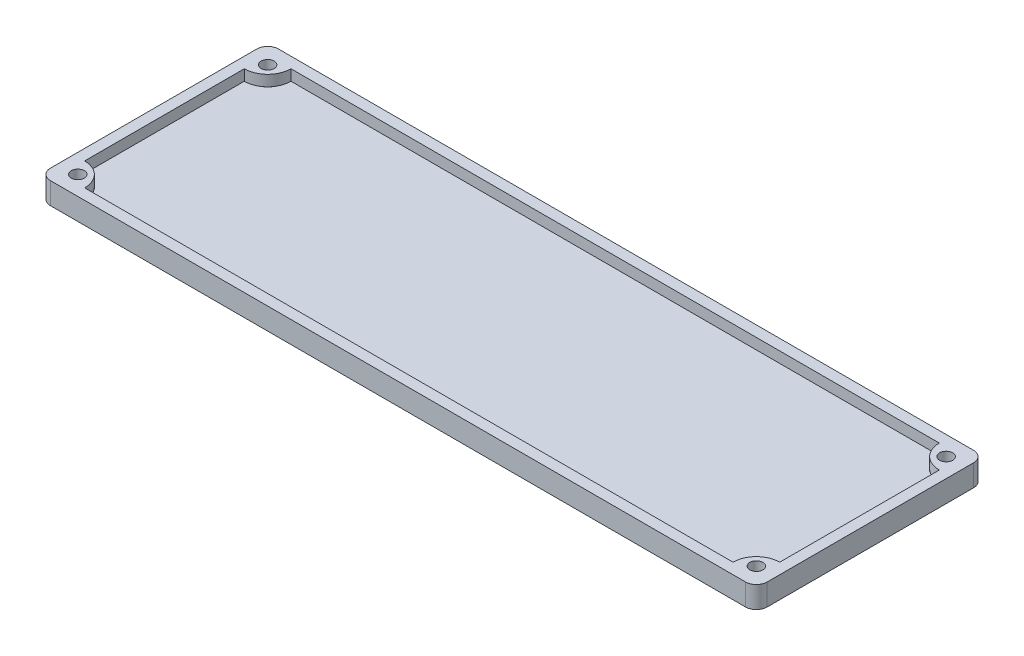
ISO-10303-21;
HEADER;
FILE_DESCRIPTION(('STEP AP214'),'2;1');
FILE_NAME('part.step','',(''),(''),'','','');
FILE_SCHEMA(('AUTOMOTIVE_DESIGN { 1 0 10303 214 1 1 1 1 }'));
ENDSEC;
DATA;
#1=APPLICATION_CONTEXT('core data for automotive mechanical design processes');
#2=APPLICATION_PROTOCOL_DEFINITION('international standard','automotive_design',2000,#1);
#3=PRODUCT_CONTEXT('',#1,'mechanical');
#4=PRODUCT('Part','Part','',(#3));
#5=PRODUCT_RELATED_PRODUCT_CATEGORY('part','',(#4));
#6=PRODUCT_DEFINITION_FORMATION('','',#4);
#7=PRODUCT_DEFINITION_CONTEXT('part definition',#1,'design');
#8=PRODUCT_DEFINITION('design','',#6,#7);
#9=PRODUCT_DEFINITION_SHAPE('','',#8);
#10=(LENGTH_UNIT() NAMED_UNIT(*) SI_UNIT(.MILLI.,.METRE.));
#11=(NAMED_UNIT(*) PLANE_ANGLE_UNIT() SI_UNIT($,.RADIAN.));
#12=(NAMED_UNIT(*) SI_UNIT($,.STERADIAN.) SOLID_ANGLE_UNIT());
#13=UNCERTAINTY_MEASURE_WITH_UNIT(LENGTH_MEASURE(1.E-05),#10,'distance_accuracy_value','');
#14=(GEOMETRIC_REPRESENTATION_CONTEXT(3) GLOBAL_UNCERTAINTY_ASSIGNED_CONTEXT((#13)) GLOBAL_UNIT_ASSIGNED_CONTEXT((#10,
#11,#12)) REPRESENTATION_CONTEXT('',''));
#15=CARTESIAN_POINT('',(0.,0.,0.));
#16=DIRECTION('',(0.,0.,1.));
#17=DIRECTION('',(1.,0.,0.));
#18=AXIS2_PLACEMENT_3D('',#15,#16,#17);
#19=CARTESIAN_POINT('',(1.76013978977554,0.,-19.2398602102245));
#20=DIRECTION('',(0.,1.,0.));
#21=DIRECTION('',(0.,0.,1.));
#22=AXIS2_PLACEMENT_3D('',#19,#20,#21);
#23=CYLINDRICAL_SURFACE('',#22,0.6);
#24=CARTESIAN_POINT('',(1.76013978977554,2.,-19.2398602102245));
#25=DIRECTION('',(0.,1.,0.));
#26=DIRECTION('',(0.,0.,1.));
#27=AXIS2_PLACEMENT_3D('',#24,#25,#26);
#28=CIRCLE('',#27,0.6);
#29=CARTESIAN_POINT('',(1.76013978977554,2.,-18.6398602102245));
#30=VERTEX_POINT('',#29);
#31=EDGE_CURVE('E701',#30,#30,#28,.T.);
#32=ORIENTED_EDGE('',*,*,#31,.T.);
#33=EDGE_LOOP('',(#32));
#34=FACE_BOUND('',#33,.T.);
#35=CARTESIAN_POINT('',(1.76013978977554,1.,-19.2398602102245));
#36=DIRECTION('',(0.,-1.,0.));
#37=DIRECTION('',(0.,0.,-1.));
#38=AXIS2_PLACEMENT_3D('',#35,#36,#37);
#39=CIRCLE('',#38,0.6);
#40=CARTESIAN_POINT('',(1.76013978977554,1.,-19.8398602102245));
#41=VERTEX_POINT('',#40);
#42=EDGE_CURVE('E306',#41,#41,#39,.F.);
#43=ORIENTED_EDGE('',*,*,#42,.F.);
#44=EDGE_LOOP('',(#43));
#45=FACE_BOUND('',#44,.T.);
#46=ADVANCED_FACE('F39',(#34,#45),#23,.F.);
#47=CARTESIAN_POINT('',(64.2498602102245,0.,-1.76013978977554));
#48=DIRECTION('',(0.,1.,0.));
#49=DIRECTION('',(0.,0.,1.));
#50=AXIS2_PLACEMENT_3D('',#47,#48,#49);
#51=CYLINDRICAL_SURFACE('',#50,0.600000000000007);
#52=CARTESIAN_POINT('',(64.2498602102245,2.,-1.76013978977554));
#53=DIRECTION('',(0.,1.,0.));
#54=DIRECTION('',(0.,0.,1.));
#55=AXIS2_PLACEMENT_3D('',#52,#53,#54);
#56=CIRCLE('',#55,0.600000000000007);
#57=CARTESIAN_POINT('',(64.2498602102245,2.,-1.16013978977553));
#58=VERTEX_POINT('',#57);
#59=EDGE_CURVE('E709',#58,#58,#56,.T.);
#60=ORIENTED_EDGE('',*,*,#59,.T.);
#61=EDGE_LOOP('',(#60));
#62=FACE_BOUND('',#61,.T.);
#63=CARTESIAN_POINT('',(64.2498602102245,1.,-1.76013978977554));
#64=DIRECTION('',(0.,-1.,0.));
#65=DIRECTION('',(0.,0.,-1.));
#66=AXIS2_PLACEMENT_3D('',#63,#64,#65);
#67=CIRCLE('',#66,0.600000000000007);
#68=CARTESIAN_POINT('',(64.2498602102245,1.,-2.36013978977555));
#69=VERTEX_POINT('',#68);
#70=EDGE_CURVE('E301',#69,#69,#67,.F.);
#71=ORIENTED_EDGE('',*,*,#70,.F.);
#72=EDGE_LOOP('',(#71));
#73=FACE_BOUND('',#72,.T.);
#74=ADVANCED_FACE('F393',(#62,#73),#51,.F.);
#75=CARTESIAN_POINT('',(64.2498602102245,0.,-19.2398602102245));
#76=DIRECTION('',(0.,1.,0.));
#77=DIRECTION('',(0.,0.,1.));
#78=AXIS2_PLACEMENT_3D('',#75,#76,#77);
#79=CYLINDRICAL_SURFACE('',#78,0.600000000000007);
#80=CARTESIAN_POINT('',(64.2498602102245,2.,-19.2398602102245));
#81=DIRECTION('',(0.,1.,0.));
#82=DIRECTION('',(0.,0.,1.));
#83=AXIS2_PLACEMENT_3D('',#80,#81,#82);
#84=CIRCLE('',#83,0.600000000000007);
#85=CARTESIAN_POINT('',(64.2498602102245,2.,-18.6398602102245));
#86=VERTEX_POINT('',#85);
#87=EDGE_CURVE('E702',#86,#86,#84,.T.);
#88=ORIENTED_EDGE('',*,*,#87,.T.);
#89=EDGE_LOOP('',(#88));
#90=FACE_BOUND('',#89,.T.);
#91=CARTESIAN_POINT('',(64.2498602102245,1.,-19.2398602102245));
#92=DIRECTION('',(0.,-1.,0.));
#93=DIRECTION('',(0.,0.,-1.));
#94=AXIS2_PLACEMENT_3D('',#91,#92,#93);
#95=CIRCLE('',#94,0.600000000000007);
#96=CARTESIAN_POINT('',(64.2498602102245,1.,-19.8398602102245));
#97=VERTEX_POINT('',#96);
#98=EDGE_CURVE('E211',#97,#97,#95,.F.);
#99=ORIENTED_EDGE('',*,*,#98,.F.);
#100=EDGE_LOOP('',(#99));
#101=FACE_BOUND('',#100,.T.);
#102=ADVANCED_FACE('F399',(#90,#101),#79,.F.);
#103=CARTESIAN_POINT('',(1.76013978977554,0.,-1.76013978977554));
#104=DIRECTION('',(0.,1.,0.));
#105=DIRECTION('',(0.,0.,1.));
#106=AXIS2_PLACEMENT_3D('',#103,#104,#105);
#107=CYLINDRICAL_SURFACE('',#106,0.6);
#108=CARTESIAN_POINT('',(1.76013978977554,2.,-1.76013978977554));
#109=DIRECTION('',(0.,1.,0.));
#110=DIRECTION('',(0.,0.,1.));
#111=AXIS2_PLACEMENT_3D('',#108,#109,#110);
#112=CIRCLE('',#111,0.6);
#113=CARTESIAN_POINT('',(1.76013978977554,2.,-1.16013978977554));
#114=VERTEX_POINT('',#113);
#115=EDGE_CURVE('E698',#114,#114,#112,.T.);
#116=ORIENTED_EDGE('',*,*,#115,.T.);
#117=EDGE_LOOP('',(#116));
#118=FACE_BOUND('',#117,.T.);
#119=CARTESIAN_POINT('',(1.76013978977554,1.,-1.76013978977554));
#120=DIRECTION('',(0.,-1.,0.));
#121=DIRECTION('',(0.,0.,-1.));
#122=AXIS2_PLACEMENT_3D('',#119,#120,#121);
#123=CIRCLE('',#122,0.6);
#124=CARTESIAN_POINT('',(1.76013978977554,1.,-2.36013978977554));
#125=VERTEX_POINT('',#124);
#126=EDGE_CURVE('E195',#125,#125,#123,.F.);
#127=ORIENTED_EDGE('',*,*,#126,.F.);
#128=EDGE_LOOP('',(#127));
#129=FACE_BOUND('',#128,.T.);
#130=ADVANCED_FACE('F453',(#118,#129),#107,.F.);
#131=CARTESIAN_POINT('',(0.,1.,0.));
#132=DIRECTION('',(1.,0.,0.));
#133=DIRECTION('',(0.,0.,-1.));
#134=AXIS2_PLACEMENT_3D('',#131,#132,#133);
#135=PLANE('',#134);
#136=DIRECTION('',(0.,0.,1.));
#137=VECTOR('',#136,1.);
#138=CARTESIAN_POINT('',(0.,0.,0.));
#139=LINE('',#138,#137);
#140=CARTESIAN_POINT('',(0.,0.,-20.));
#141=VERTEX_POINT('',#140);
#142=CARTESIAN_POINT('',(0.,0.,-1.));
#143=VERTEX_POINT('',#142);
#144=EDGE_CURVE('E285',#141,#143,#139,.T.);
#145=ORIENTED_EDGE('',*,*,#144,.T.);
#146=DIRECTION('',(0.,-1.,0.));
#147=VECTOR('',#146,1.);
#148=CARTESIAN_POINT('',(0.,1.,-1.));
#149=LINE('',#148,#147);
#150=CARTESIAN_POINT('',(0.,2.,-1.00000000000001));
#151=VERTEX_POINT('',#150);
#152=EDGE_CURVE('E11',#143,#151,#149,.F.);
#153=ORIENTED_EDGE('',*,*,#152,.T.);
#154=DIRECTION('',(0.,0.,1.));
#155=VECTOR('',#154,1.);
#156=CARTESIAN_POINT('',(0.,2.,-21.));
#157=LINE('',#156,#155);
#158=CARTESIAN_POINT('',(0.,2.,-20.));
#159=VERTEX_POINT('',#158);
#160=EDGE_CURVE('E282',#159,#151,#157,.T.);
#161=ORIENTED_EDGE('',*,*,#160,.F.);
#162=DIRECTION('',(0.,-1.,0.));
#163=VECTOR('',#162,1.);
#164=CARTESIAN_POINT('',(0.,1.,-20.));
#165=LINE('',#164,#163);
#166=EDGE_CURVE('E48',#159,#141,#165,.T.);
#167=ORIENTED_EDGE('',*,*,#166,.T.);
#168=EDGE_LOOP('',(#145,#153,#161,#167));
#169=FACE_BOUND('',#168,.T.);
#170=ADVANCED_FACE('F356',(#169),#135,.F.);
#171=CARTESIAN_POINT('',(0.,1.,0.));
#172=DIRECTION('',(0.,0.,-1.));
#173=DIRECTION('',(-1.,0.,0.));
#174=AXIS2_PLACEMENT_3D('',#171,#172,#173);
#175=PLANE('',#174);
#176=DIRECTION('',(1.,0.,0.));
#177=VECTOR('',#176,1.);
#178=CARTESIAN_POINT('',(0.,0.,0.));
#179=LINE('',#178,#177);
#180=CARTESIAN_POINT('',(1.,0.,0.));
#181=VERTEX_POINT('',#180);
#182=CARTESIAN_POINT('',(65.01,0.,0.));
#183=VERTEX_POINT('',#182);
#184=EDGE_CURVE('E288',#181,#183,#179,.T.);
#185=ORIENTED_EDGE('',*,*,#184,.T.);
#186=DIRECTION('',(0.,-1.,0.));
#187=VECTOR('',#186,1.);
#188=CARTESIAN_POINT('',(65.01,1.,0.));
#189=LINE('',#188,#187);
#190=CARTESIAN_POINT('',(65.01,2.,0.));
#191=VERTEX_POINT('',#190);
#192=EDGE_CURVE('E332',#183,#191,#189,.F.);
#193=ORIENTED_EDGE('',*,*,#192,.T.);
#194=DIRECTION('',(1.,0.,0.));
#195=VECTOR('',#194,1.);
#196=CARTESIAN_POINT('',(0.,2.,0.));
#197=LINE('',#196,#195);
#198=CARTESIAN_POINT('',(1.,2.,0.));
#199=VERTEX_POINT('',#198);
#200=EDGE_CURVE('E258',#199,#191,#197,.T.);
#201=ORIENTED_EDGE('',*,*,#200,.F.);
#202=DIRECTION('',(0.,-1.,0.));
#203=VECTOR('',#202,1.);
#204=CARTESIAN_POINT('',(1.,1.,0.));
#205=LINE('',#204,#203);
#206=EDGE_CURVE('E328',#199,#181,#205,.T.);
#207=ORIENTED_EDGE('',*,*,#206,.T.);
#208=EDGE_LOOP('',(#185,#193,#201,#207));
#209=FACE_BOUND('',#208,.T.);
#210=ADVANCED_FACE('F369',(#209),#175,.F.);
#211=CARTESIAN_POINT('',(66.01,1.,0.));
#212=DIRECTION('',(-1.,0.,0.));
#213=DIRECTION('',(0.,0.,1.));
#214=AXIS2_PLACEMENT_3D('',#211,#212,#213);
#215=PLANE('',#214);
#216=DIRECTION('',(0.,0.,-1.));
#217=VECTOR('',#216,1.);
#218=CARTESIAN_POINT('',(66.01,2.,0.));
#219=LINE('',#218,#217);
#220=CARTESIAN_POINT('',(66.01,2.,-1.));
#221=VERTEX_POINT('',#220);
#222=CARTESIAN_POINT('',(66.01,2.,-20.));
#223=VERTEX_POINT('',#222);
#224=EDGE_CURVE('E275',#221,#223,#219,.T.);
#225=ORIENTED_EDGE('',*,*,#224,.F.);
#226=DIRECTION('',(0.,-1.,0.));
#227=VECTOR('',#226,1.);
#228=CARTESIAN_POINT('',(66.01,1.,-1.));
#229=LINE('',#228,#227);
#230=CARTESIAN_POINT('',(66.01,0.,-1.));
#231=VERTEX_POINT('',#230);
#232=EDGE_CURVE('E312',#221,#231,#229,.T.);
#233=ORIENTED_EDGE('',*,*,#232,.T.);
#234=DIRECTION('',(0.,0.,-1.));
#235=VECTOR('',#234,1.);
#236=CARTESIAN_POINT('',(66.01,0.,0.));
#237=LINE('',#236,#235);
#238=CARTESIAN_POINT('',(66.01,0.,-20.));
#239=VERTEX_POINT('',#238);
#240=EDGE_CURVE('E292',#231,#239,#237,.T.);
#241=ORIENTED_EDGE('',*,*,#240,.T.);
#242=DIRECTION('',(0.,-1.,0.));
#243=VECTOR('',#242,1.);
#244=CARTESIAN_POINT('',(66.01,1.,-20.));
#245=LINE('',#244,#243);
#246=EDGE_CURVE('E299',#239,#223,#245,.F.);
#247=ORIENTED_EDGE('',*,*,#246,.T.);
#248=EDGE_LOOP('',(#225,#233,#241,#247));
#249=FACE_BOUND('',#248,.T.);
#250=ADVANCED_FACE('F378',(#249),#215,.F.);
#251=CARTESIAN_POINT('',(0.,1.,-21.));
#252=DIRECTION('',(0.,0.,1.));
#253=DIRECTION('',(1.,0.,0.));
#254=AXIS2_PLACEMENT_3D('',#251,#252,#253);
#255=PLANE('',#254);
#256=DIRECTION('',(-1.,0.,0.));
#257=VECTOR('',#256,1.);
#258=CARTESIAN_POINT('',(66.01,2.,-21.));
#259=LINE('',#258,#257);
#260=CARTESIAN_POINT('',(65.01,2.,-21.));
#261=VERTEX_POINT('',#260);
#262=CARTESIAN_POINT('',(1.,2.,-21.));
#263=VERTEX_POINT('',#262);
#264=EDGE_CURVE('E279',#261,#263,#259,.T.);
#265=ORIENTED_EDGE('',*,*,#264,.F.);
#266=DIRECTION('',(0.,-1.,0.));
#267=VECTOR('',#266,1.);
#268=CARTESIAN_POINT('',(65.01,1.,-21.));
#269=LINE('',#268,#267);
#270=CARTESIAN_POINT('',(65.01,0.,-21.));
#271=VERTEX_POINT('',#270);
#272=EDGE_CURVE('E349',#261,#271,#269,.T.);
#273=ORIENTED_EDGE('',*,*,#272,.T.);
#274=DIRECTION('',(-1.,0.,0.));
#275=VECTOR('',#274,1.);
#276=CARTESIAN_POINT('',(0.,0.,-21.));
#277=LINE('',#276,#275);
#278=CARTESIAN_POINT('',(1.,0.,-21.));
#279=VERTEX_POINT('',#278);
#280=EDGE_CURVE('E296',#271,#279,#277,.T.);
#281=ORIENTED_EDGE('',*,*,#280,.T.);
#282=DIRECTION('',(0.,-1.,0.));
#283=VECTOR('',#282,1.);
#284=CARTESIAN_POINT('',(1.,1.,-21.));
#285=LINE('',#284,#283);
#286=EDGE_CURVE('E346',#279,#263,#285,.F.);
#287=ORIENTED_EDGE('',*,*,#286,.T.);
#288=EDGE_LOOP('',(#265,#273,#281,#287));
#289=FACE_BOUND('',#288,.T.);
#290=ADVANCED_FACE('F386',(#289),#255,.F.);
#291=CARTESIAN_POINT('',(0.,0.,0.));
#292=DIRECTION('',(0.,-1.,0.));
#293=DIRECTION('',(0.,0.,-1.));
#294=AXIS2_PLACEMENT_3D('',#291,#292,#293);
#295=PLANE('',#294);
#296=CARTESIAN_POINT('',(1.76013978977554,0.,-19.2398602102245));
#297=DIRECTION('',(0.,-1.,0.));
#298=DIRECTION('',(0.,0.,-1.));
#299=AXIS2_PLACEMENT_3D('',#296,#297,#298);
#300=CIRCLE('',#299,1.1);
#301=CARTESIAN_POINT('',(1.76013978977554,0.,-20.3398602102245));
#302=VERTEX_POINT('',#301);
#303=EDGE_CURVE('E768',#302,#302,#300,.T.);
#304=ORIENTED_EDGE('',*,*,#303,.F.);
#305=EDGE_LOOP('',(#304));
#306=FACE_BOUND('',#305,.T.);
#307=CARTESIAN_POINT('',(64.2498602102245,0.,-19.2398602102245));
#308=DIRECTION('',(0.,-1.,0.));
#309=DIRECTION('',(0.,0.,-1.));
#310=AXIS2_PLACEMENT_3D('',#307,#308,#309);
#311=CIRCLE('',#310,1.10000000000001);
#312=CARTESIAN_POINT('',(64.2498602102245,0.,-20.3398602102245));
#313=VERTEX_POINT('',#312);
#314=EDGE_CURVE('E760',#313,#313,#311,.T.);
#315=ORIENTED_EDGE('',*,*,#314,.F.);
#316=EDGE_LOOP('',(#315));
#317=FACE_BOUND('',#316,.T.);
#318=CARTESIAN_POINT('',(64.2498602102245,0.,-1.76013978977553));
#319=DIRECTION('',(0.,-1.,0.));
#320=DIRECTION('',(0.,0.,-1.));
#321=AXIS2_PLACEMENT_3D('',#318,#319,#320);
#322=CIRCLE('',#321,1.10000000000001);
#323=CARTESIAN_POINT('',(64.2498602102245,0.,-2.86013978977554));
#324=VERTEX_POINT('',#323);
#325=EDGE_CURVE('E785',#324,#324,#322,.T.);
#326=ORIENTED_EDGE('',*,*,#325,.F.);
#327=EDGE_LOOP('',(#326));
#328=FACE_BOUND('',#327,.T.);
#329=CARTESIAN_POINT('',(1.76013978977554,0.,-1.76013978977554));
#330=DIRECTION('',(0.,-1.,0.));
#331=DIRECTION('',(0.,0.,-1.));
#332=AXIS2_PLACEMENT_3D('',#329,#330,#331);
#333=CIRCLE('',#332,1.1);
#334=CARTESIAN_POINT('',(1.76013978977554,0.,-2.86013978977554));
#335=VERTEX_POINT('',#334);
#336=EDGE_CURVE('E186',#335,#335,#333,.T.);
#337=ORIENTED_EDGE('',*,*,#336,.F.);
#338=EDGE_LOOP('',(#337));
#339=FACE_BOUND('',#338,.T.);
#340=ORIENTED_EDGE('',*,*,#240,.F.);
#341=CARTESIAN_POINT('',(65.01,0.,-1.));
#342=DIRECTION('',(0.,-1.,0.));
#343=DIRECTION('',(0.,0.,-1.));
#344=AXIS2_PLACEMENT_3D('',#341,#342,#343);
#345=CIRCLE('',#344,1.);
#346=EDGE_CURVE('E325',#231,#183,#345,.T.);
#347=ORIENTED_EDGE('',*,*,#346,.T.);
#348=ORIENTED_EDGE('',*,*,#184,.F.);
#349=CARTESIAN_POINT('',(1.,0.,-1.));
#350=DIRECTION('',(0.,-1.,0.));
#351=DIRECTION('',(0.,0.,-1.));
#352=AXIS2_PLACEMENT_3D('',#349,#350,#351);
#353=CIRCLE('',#352,1.);
#354=EDGE_CURVE('E319',#181,#143,#353,.T.);
#355=ORIENTED_EDGE('',*,*,#354,.T.);
#356=ORIENTED_EDGE('',*,*,#144,.F.);
#357=CARTESIAN_POINT('',(1.,0.,-20.));
#358=DIRECTION('',(0.,-1.,0.));
#359=DIRECTION('',(0.,0.,-1.));
#360=AXIS2_PLACEMENT_3D('',#357,#358,#359);
#361=CIRCLE('',#360,1.);
#362=EDGE_CURVE('E316',#141,#279,#361,.T.);
#363=ORIENTED_EDGE('',*,*,#362,.T.);
#364=ORIENTED_EDGE('',*,*,#280,.F.);
#365=CARTESIAN_POINT('',(65.01,0.,-20.));
#366=DIRECTION('',(0.,-1.,0.));
#367=DIRECTION('',(0.,0.,-1.));
#368=AXIS2_PLACEMENT_3D('',#365,#366,#367);
#369=CIRCLE('',#368,1.);
#370=EDGE_CURVE('E322',#271,#239,#369,.T.);
#371=ORIENTED_EDGE('',*,*,#370,.T.);
#372=EDGE_LOOP('',(#340,#347,#348,#355,#356,#363,#364,#371));
#373=FACE_BOUND('',#372,.T.);
#374=ADVANCED_FACE('F360',(#306,#317,#328,#339,#373),#295,.T.);
#375=CARTESIAN_POINT('',(0.,2.,0.));
#376=DIRECTION('',(0.,1.,0.));
#377=DIRECTION('',(0.,0.,1.));
#378=AXIS2_PLACEMENT_3D('',#375,#376,#377);
#379=PLANE('',#378);
#380=ORIENTED_EDGE('',*,*,#115,.F.);
#381=EDGE_LOOP('',(#380));
#382=FACE_BOUND('',#381,.T.);
#383=ORIENTED_EDGE('',*,*,#87,.F.);
#384=EDGE_LOOP('',(#383));
#385=FACE_BOUND('',#384,.T.);
#386=ORIENTED_EDGE('',*,*,#59,.F.);
#387=EDGE_LOOP('',(#386));
#388=FACE_BOUND('',#387,.T.);
#389=ORIENTED_EDGE('',*,*,#31,.F.);
#390=EDGE_LOOP('',(#389));
#391=FACE_BOUND('',#390,.T.);
#392=DIRECTION('',(0.,0.,1.));
#393=VECTOR('',#392,1.);
#394=CARTESIAN_POINT('',(1.,2.,-20.));
#395=LINE('',#394,#393);
#396=CARTESIAN_POINT('',(1.,2.,-17.85));
#397=VERTEX_POINT('',#396);
#398=CARTESIAN_POINT('',(1.,2.,-3.15));
#399=VERTEX_POINT('',#398);
#400=EDGE_CURVE('E243',#397,#399,#395,.T.);
#401=ORIENTED_EDGE('',*,*,#400,.F.);
#402=CARTESIAN_POINT('',(0.999999999999992,2.,-20.));
#403=DIRECTION('',(0.,1.,0.));
#404=DIRECTION('',(0.,0.,-1.));
#405=AXIS2_PLACEMENT_3D('',#402,#403,#404);
#406=CIRCLE('',#405,2.15000000000001);
#407=CARTESIAN_POINT('',(3.15,2.,-20.));
#408=VERTEX_POINT('',#407);
#409=EDGE_CURVE('E222',#397,#408,#406,.T.);
#410=ORIENTED_EDGE('',*,*,#409,.T.);
#411=DIRECTION('',(-1.,0.,0.));
#412=VECTOR('',#411,1.);
#413=CARTESIAN_POINT('',(1.,2.,-20.));
#414=LINE('',#413,#412);
#415=CARTESIAN_POINT('',(62.86,2.,-20.));
#416=VERTEX_POINT('',#415);
#417=EDGE_CURVE('E255',#416,#408,#414,.T.);
#418=ORIENTED_EDGE('',*,*,#417,.F.);
#419=CARTESIAN_POINT('',(65.01,2.,-20.));
#420=DIRECTION('',(0.,1.,0.));
#421=DIRECTION('',(0.,0.,1.));
#422=AXIS2_PLACEMENT_3D('',#419,#420,#421);
#423=CIRCLE('',#422,2.15000000000002);
#424=CARTESIAN_POINT('',(65.01,2.,-17.85));
#425=VERTEX_POINT('',#424);
#426=EDGE_CURVE('E729',#416,#425,#423,.T.);
#427=ORIENTED_EDGE('',*,*,#426,.T.);
#428=DIRECTION('',(0.,0.,-1.));
#429=VECTOR('',#428,1.);
#430=CARTESIAN_POINT('',(65.01,2.,-20.));
#431=LINE('',#430,#429);
#432=CARTESIAN_POINT('',(65.01,2.,-3.15));
#433=VERTEX_POINT('',#432);
#434=EDGE_CURVE('E252',#433,#425,#431,.T.);
#435=ORIENTED_EDGE('',*,*,#434,.F.);
#436=CARTESIAN_POINT('',(65.01,2.,-0.999999999999996));
#437=DIRECTION('',(0.,1.,0.));
#438=DIRECTION('',(0.,0.,1.));
#439=AXIS2_PLACEMENT_3D('',#436,#437,#438);
#440=CIRCLE('',#439,2.15);
#441=CARTESIAN_POINT('',(62.86,2.,-1.));
#442=VERTEX_POINT('',#441);
#443=EDGE_CURVE('E706',#433,#442,#440,.T.);
#444=ORIENTED_EDGE('',*,*,#443,.T.);
#445=DIRECTION('',(1.,0.,0.));
#446=VECTOR('',#445,1.);
#447=CARTESIAN_POINT('',(1.,2.,-1.));
#448=LINE('',#447,#446);
#449=CARTESIAN_POINT('',(3.15,2.,-1.));
#450=VERTEX_POINT('',#449);
#451=EDGE_CURVE('E247',#450,#442,#448,.T.);
#452=ORIENTED_EDGE('',*,*,#451,.F.);
#453=CARTESIAN_POINT('',(0.999999999999999,2.,-0.999999999999998));
#454=DIRECTION('',(0.,1.,0.));
#455=DIRECTION('',(0.,0.,-1.));
#456=AXIS2_PLACEMENT_3D('',#453,#454,#455);
#457=CIRCLE('',#456,2.15);
#458=EDGE_CURVE('E746',#450,#399,#457,.T.);
#459=ORIENTED_EDGE('',*,*,#458,.T.);
#460=EDGE_LOOP('',(#401,#410,#418,#427,#435,#444,#452,#459));
#461=FACE_BOUND('',#460,.T.);
#462=ORIENTED_EDGE('',*,*,#200,.T.);
#463=CARTESIAN_POINT('',(65.01,2.,-1.));
#464=DIRECTION('',(0.,1.,0.));
#465=DIRECTION('',(0.,0.,1.));
#466=AXIS2_PLACEMENT_3D('',#463,#464,#465);
#467=CIRCLE('',#466,1.);
#468=EDGE_CURVE('E343',#191,#221,#467,.T.);
#469=ORIENTED_EDGE('',*,*,#468,.T.);
#470=ORIENTED_EDGE('',*,*,#224,.T.);
#471=CARTESIAN_POINT('',(65.01,2.,-20.));
#472=DIRECTION('',(0.,1.,0.));
#473=DIRECTION('',(0.,0.,1.));
#474=AXIS2_PLACEMENT_3D('',#471,#472,#473);
#475=CIRCLE('',#474,1.);
#476=EDGE_CURVE('E340',#223,#261,#475,.T.);
#477=ORIENTED_EDGE('',*,*,#476,.T.);
#478=ORIENTED_EDGE('',*,*,#264,.T.);
#479=CARTESIAN_POINT('',(1.,2.,-20.));
#480=DIRECTION('',(0.,1.,0.));
#481=DIRECTION('',(0.,0.,1.));
#482=AXIS2_PLACEMENT_3D('',#479,#480,#481);
#483=CIRCLE('',#482,1.);
#484=EDGE_CURVE('E60',#263,#159,#483,.T.);
#485=ORIENTED_EDGE('',*,*,#484,.T.);
#486=ORIENTED_EDGE('',*,*,#160,.T.);
#487=CARTESIAN_POINT('',(1.,2.,-1.));
#488=DIRECTION('',(0.,1.,0.));
#489=DIRECTION('',(0.,0.,1.));
#490=AXIS2_PLACEMENT_3D('',#487,#488,#489);
#491=CIRCLE('',#490,1.);
#492=EDGE_CURVE('E337',#151,#199,#491,.T.);
#493=ORIENTED_EDGE('',*,*,#492,.T.);
#494=EDGE_LOOP('',(#462,#469,#470,#477,#478,#485,#486,#493));
#495=FACE_BOUND('',#494,.T.);
#496=ADVANCED_FACE('F372',(#382,#385,#388,#391,#461,#495),#379,.T.);
#497=CARTESIAN_POINT('',(1.,2.,-20.));
#498=DIRECTION('',(1.,0.,0.));
#499=DIRECTION('',(0.,0.,-1.));
#500=AXIS2_PLACEMENT_3D('',#497,#498,#499);
#501=PLANE('',#500);
#502=DIRECTION('',(0.,1.,0.));
#503=VECTOR('',#502,1.);
#504=CARTESIAN_POINT('',(1.,-0.00199999999999983,-3.15));
#505=LINE('',#504,#503);
#506=CARTESIAN_POINT('',(1.,1.,-3.15));
#507=VERTEX_POINT('',#506);
#508=EDGE_CURVE('E750',#507,#399,#505,.T.);
#509=ORIENTED_EDGE('',*,*,#508,.F.);
#510=DIRECTION('',(0.,0.,1.));
#511=VECTOR('',#510,1.);
#512=CARTESIAN_POINT('',(1.,1.,-20.));
#513=LINE('',#512,#511);
#514=CARTESIAN_POINT('',(1.,1.,-17.85));
#515=VERTEX_POINT('',#514);
#516=EDGE_CURVE('E202',#515,#507,#513,.T.);
#517=ORIENTED_EDGE('',*,*,#516,.F.);
#518=DIRECTION('',(0.,1.,0.));
#519=VECTOR('',#518,1.);
#520=CARTESIAN_POINT('',(1.,-0.00199999999999983,-17.85));
#521=LINE('',#520,#519);
#522=EDGE_CURVE('E231',#515,#397,#521,.T.);
#523=ORIENTED_EDGE('',*,*,#522,.T.);
#524=ORIENTED_EDGE('',*,*,#400,.T.);
#525=EDGE_LOOP('',(#509,#517,#523,#524));
#526=FACE_BOUND('',#525,.T.);
#527=ADVANCED_FACE('F432',(#526),#501,.T.);
#528=CARTESIAN_POINT('',(1.,2.,-1.));
#529=DIRECTION('',(0.,0.,-1.));
#530=DIRECTION('',(-1.,0.,0.));
#531=AXIS2_PLACEMENT_3D('',#528,#529,#530);
#532=PLANE('',#531);
#533=DIRECTION('',(0.,1.,0.));
#534=VECTOR('',#533,1.);
#535=CARTESIAN_POINT('',(62.86,-0.00199999999999983,-1.));
#536=LINE('',#535,#534);
#537=CARTESIAN_POINT('',(62.86,1.,-1.));
#538=VERTEX_POINT('',#537);
#539=EDGE_CURVE('E717',#538,#442,#536,.T.);
#540=ORIENTED_EDGE('',*,*,#539,.F.);
#541=DIRECTION('',(1.,0.,0.));
#542=VECTOR('',#541,1.);
#543=CARTESIAN_POINT('',(1.,1.,-1.));
#544=LINE('',#543,#542);
#545=CARTESIAN_POINT('',(3.15,1.,-1.));
#546=VERTEX_POINT('',#545);
#547=EDGE_CURVE('E261',#546,#538,#544,.T.);
#548=ORIENTED_EDGE('',*,*,#547,.F.);
#549=DIRECTION('',(0.,1.,0.));
#550=VECTOR('',#549,1.);
#551=CARTESIAN_POINT('',(3.15,-0.00199999999999983,-1.));
#552=LINE('',#551,#550);
#553=EDGE_CURVE('E207',#546,#450,#552,.T.);
#554=ORIENTED_EDGE('',*,*,#553,.T.);
#555=ORIENTED_EDGE('',*,*,#451,.T.);
#556=EDGE_LOOP('',(#540,#548,#554,#555));
#557=FACE_BOUND('',#556,.T.);
#558=ADVANCED_FACE('F428',(#557),#532,.T.);
#559=CARTESIAN_POINT('',(65.01,2.,-20.));
#560=DIRECTION('',(-1.,0.,0.));
#561=DIRECTION('',(0.,0.,1.));
#562=AXIS2_PLACEMENT_3D('',#559,#560,#561);
#563=PLANE('',#562);
#564=DIRECTION('',(0.,1.,0.));
#565=VECTOR('',#564,1.);
#566=CARTESIAN_POINT('',(65.01,-0.00199999999999983,-3.15));
#567=LINE('',#566,#565);
#568=CARTESIAN_POINT('',(65.01,1.,-3.15));
#569=VERTEX_POINT('',#568);
#570=EDGE_CURVE('E718',#569,#433,#567,.T.);
#571=ORIENTED_EDGE('',*,*,#570,.T.);
#572=ORIENTED_EDGE('',*,*,#434,.T.);
#573=DIRECTION('',(0.,1.,0.));
#574=VECTOR('',#573,1.);
#575=CARTESIAN_POINT('',(65.01,-0.00199999999999983,-17.85));
#576=LINE('',#575,#574);
#577=CARTESIAN_POINT('',(65.01,1.,-17.85));
#578=VERTEX_POINT('',#577);
#579=EDGE_CURVE('E733',#578,#425,#576,.T.);
#580=ORIENTED_EDGE('',*,*,#579,.F.);
#581=DIRECTION('',(0.,0.,-1.));
#582=VECTOR('',#581,1.);
#583=CARTESIAN_POINT('',(65.01,1.,-20.));
#584=LINE('',#583,#582);
#585=EDGE_CURVE('E265',#569,#578,#584,.T.);
#586=ORIENTED_EDGE('',*,*,#585,.F.);
#587=EDGE_LOOP('',(#571,#572,#580,#586));
#588=FACE_BOUND('',#587,.T.);
#589=ADVANCED_FACE('F424',(#588),#563,.T.);
#590=CARTESIAN_POINT('',(1.,2.,-20.));
#591=DIRECTION('',(0.,0.,1.));
#592=DIRECTION('',(1.,0.,0.));
#593=AXIS2_PLACEMENT_3D('',#590,#591,#592);
#594=PLANE('',#593);
#595=DIRECTION('',(0.,1.,0.));
#596=VECTOR('',#595,1.);
#597=CARTESIAN_POINT('',(62.86,-0.00199999999999983,-20.));
#598=LINE('',#597,#596);
#599=CARTESIAN_POINT('',(62.86,1.,-20.));
#600=VERTEX_POINT('',#599);
#601=EDGE_CURVE('E737',#600,#416,#598,.T.);
#602=ORIENTED_EDGE('',*,*,#601,.T.);
#603=ORIENTED_EDGE('',*,*,#417,.T.);
#604=DIRECTION('',(0.,1.,0.));
#605=VECTOR('',#604,1.);
#606=CARTESIAN_POINT('',(3.15,-0.00199999999999983,-20.));
#607=LINE('',#606,#605);
#608=CARTESIAN_POINT('',(3.15,1.,-20.));
#609=VERTEX_POINT('',#608);
#610=EDGE_CURVE('E225',#609,#408,#607,.T.);
#611=ORIENTED_EDGE('',*,*,#610,.F.);
#612=DIRECTION('',(-1.,0.,0.));
#613=VECTOR('',#612,1.);
#614=CARTESIAN_POINT('',(1.,1.,-20.));
#615=LINE('',#614,#613);
#616=EDGE_CURVE('E248',#600,#609,#615,.T.);
#617=ORIENTED_EDGE('',*,*,#616,.F.);
#618=EDGE_LOOP('',(#602,#603,#611,#617));
#619=FACE_BOUND('',#618,.T.);
#620=ADVANCED_FACE('F421',(#619),#594,.T.);
#621=CARTESIAN_POINT('',(0.,1.,0.));
#622=DIRECTION('',(0.,-1.,0.));
#623=DIRECTION('',(0.,0.,-1.));
#624=AXIS2_PLACEMENT_3D('',#621,#622,#623);
#625=PLANE('',#624);
#626=CARTESIAN_POINT('',(0.999999999999992,1.,-20.));
#627=DIRECTION('',(0.,-1.,0.));
#628=DIRECTION('',(0.,0.,-1.));
#629=AXIS2_PLACEMENT_3D('',#626,#627,#628);
#630=CIRCLE('',#629,2.15000000000001);
#631=CARTESIAN_POINT('',(2.73489407680064,1.,-18.7301013653515));
#632=VERTEX_POINT('',#631);
#633=EDGE_CURVE('E237',#632,#609,#630,.F.);
#634=ORIENTED_EDGE('',*,*,#633,.F.);
#635=CARTESIAN_POINT('',(1.76013978977554,1.,-19.2398602102245));
#636=DIRECTION('',(0.,-1.,0.));
#637=DIRECTION('',(0.,0.,-1.));
#638=AXIS2_PLACEMENT_3D('',#635,#636,#637);
#639=CIRCLE('',#638,1.1);
#640=CARTESIAN_POINT('',(2.26989863464847,1.,-18.2651059231994));
#641=VERTEX_POINT('',#640);
#642=EDGE_CURVE('E758',#632,#641,#639,.T.);
#643=ORIENTED_EDGE('',*,*,#642,.T.);
#644=EDGE_CURVE('E238',#515,#641,#630,.F.);
#645=ORIENTED_EDGE('',*,*,#644,.F.);
#646=ORIENTED_EDGE('',*,*,#516,.T.);
#647=CARTESIAN_POINT('',(0.999999999999999,1.,-0.999999999999998));
#648=DIRECTION('',(0.,-1.,0.));
#649=DIRECTION('',(0.,0.,-1.));
#650=AXIS2_PLACEMENT_3D('',#647,#648,#649);
#651=CIRCLE('',#650,2.15);
#652=CARTESIAN_POINT('',(2.26989863464848,1.,-2.73489407680064));
#653=VERTEX_POINT('',#652);
#654=EDGE_CURVE('E197',#653,#507,#651,.F.);
#655=ORIENTED_EDGE('',*,*,#654,.F.);
#656=CARTESIAN_POINT('',(1.76013978977554,1.,-1.76013978977554));
#657=DIRECTION('',(0.,-1.,0.));
#658=DIRECTION('',(0.,0.,-1.));
#659=AXIS2_PLACEMENT_3D('',#656,#657,#658);
#660=CIRCLE('',#659,1.1);
#661=CARTESIAN_POINT('',(2.73489407680064,1.,-2.26989863464848));
#662=VERTEX_POINT('',#661);
#663=EDGE_CURVE('E185',#653,#662,#660,.T.);
#664=ORIENTED_EDGE('',*,*,#663,.T.);
#665=EDGE_CURVE('E206',#546,#662,#651,.F.);
#666=ORIENTED_EDGE('',*,*,#665,.F.);
#667=ORIENTED_EDGE('',*,*,#547,.T.);
#668=CARTESIAN_POINT('',(65.01,1.,-0.999999999999996));
#669=DIRECTION('',(0.,-1.,0.));
#670=DIRECTION('',(0.,0.,-1.));
#671=AXIS2_PLACEMENT_3D('',#668,#669,#670);
#672=CIRCLE('',#671,2.15);
#673=CARTESIAN_POINT('',(63.2751059231994,1.,-2.2698986346485));
#674=VERTEX_POINT('',#673);
#675=EDGE_CURVE('E722',#674,#538,#672,.F.);
#676=ORIENTED_EDGE('',*,*,#675,.F.);
#677=CARTESIAN_POINT('',(64.2498602102245,1.,-1.76013978977553));
#678=DIRECTION('',(0.,-1.,0.));
#679=DIRECTION('',(0.,0.,-1.));
#680=AXIS2_PLACEMENT_3D('',#677,#678,#679);
#681=CIRCLE('',#680,1.10000000000001);
#682=CARTESIAN_POINT('',(63.7401013653515,1.,-2.73489407680063));
#683=VERTEX_POINT('',#682);
#684=EDGE_CURVE('E775',#674,#683,#681,.T.);
#685=ORIENTED_EDGE('',*,*,#684,.T.);
#686=EDGE_CURVE('E725',#569,#683,#672,.F.);
#687=ORIENTED_EDGE('',*,*,#686,.F.);
#688=ORIENTED_EDGE('',*,*,#585,.T.);
#689=CARTESIAN_POINT('',(65.01,1.,-20.));
#690=DIRECTION('',(0.,-1.,0.));
#691=DIRECTION('',(0.,0.,-1.));
#692=AXIS2_PLACEMENT_3D('',#689,#690,#691);
#693=CIRCLE('',#692,2.15000000000002);
#694=CARTESIAN_POINT('',(63.7401013653515,1.,-18.2651059231994));
#695=VERTEX_POINT('',#694);
#696=EDGE_CURVE('E741',#695,#578,#693,.F.);
#697=ORIENTED_EDGE('',*,*,#696,.F.);
#698=CARTESIAN_POINT('',(64.2498602102245,1.,-19.2398602102245));
#699=DIRECTION('',(0.,-1.,0.));
#700=DIRECTION('',(0.,0.,-1.));
#701=AXIS2_PLACEMENT_3D('',#698,#699,#700);
#702=CIRCLE('',#701,1.10000000000001);
#703=CARTESIAN_POINT('',(63.2751059231994,1.,-18.7301013653515));
#704=VERTEX_POINT('',#703);
#705=EDGE_CURVE('E789',#695,#704,#702,.T.);
#706=ORIENTED_EDGE('',*,*,#705,.T.);
#707=EDGE_CURVE('E742',#600,#704,#693,.F.);
#708=ORIENTED_EDGE('',*,*,#707,.F.);
#709=ORIENTED_EDGE('',*,*,#616,.T.);
#710=EDGE_LOOP('',(#634,#643,#645,#646,#655,#664,#666,#667,#676,#685,#687,#688,#697,#706,#708,#709));
#711=FACE_BOUND('',#710,.T.);
#712=ADVANCED_FACE('F199',(#711),#625,.F.);
#713=CARTESIAN_POINT('',(0.999999999999992,-0.00199999999999983,-20.));
#714=DIRECTION('',(0.,1.,0.));
#715=DIRECTION('',(0.,0.,1.));
#716=AXIS2_PLACEMENT_3D('',#713,#714,#715);
#717=CYLINDRICAL_SURFACE('',#716,2.15000000000001);
#718=ORIENTED_EDGE('',*,*,#522,.F.);
#719=ORIENTED_EDGE('',*,*,#644,.T.);
#720=EDGE_CURVE('E242',#641,#632,#630,.F.);
#721=ORIENTED_EDGE('',*,*,#720,.T.);
#722=ORIENTED_EDGE('',*,*,#633,.T.);
#723=ORIENTED_EDGE('',*,*,#610,.T.);
#724=ORIENTED_EDGE('',*,*,#409,.F.);
#725=EDGE_LOOP('',(#718,#719,#721,#722,#723,#724));
#726=FACE_BOUND('',#725,.T.);
#727=ADVANCED_FACE('F417',(#726),#717,.T.);
#728=CARTESIAN_POINT('',(0.999999999999999,-0.00199999999999983,-0.999999999999998));
#729=DIRECTION('',(0.,1.,0.));
#730=DIRECTION('',(0.,0.,1.));
#731=AXIS2_PLACEMENT_3D('',#728,#729,#730);
#732=CYLINDRICAL_SURFACE('',#731,2.15);
#733=ORIENTED_EDGE('',*,*,#553,.F.);
#734=ORIENTED_EDGE('',*,*,#665,.T.);
#735=EDGE_CURVE('E181',#662,#653,#651,.F.);
#736=ORIENTED_EDGE('',*,*,#735,.T.);
#737=ORIENTED_EDGE('',*,*,#654,.T.);
#738=ORIENTED_EDGE('',*,*,#508,.T.);
#739=ORIENTED_EDGE('',*,*,#458,.F.);
#740=EDGE_LOOP('',(#733,#734,#736,#737,#738,#739));
#741=FACE_BOUND('',#740,.T.);
#742=ADVANCED_FACE('F209',(#741),#732,.T.);
#743=CARTESIAN_POINT('',(65.01,-0.00199999999999983,-20.));
#744=DIRECTION('',(0.,1.,0.));
#745=DIRECTION('',(0.,0.,1.));
#746=AXIS2_PLACEMENT_3D('',#743,#744,#745);
#747=CYLINDRICAL_SURFACE('',#746,2.15000000000002);
#748=ORIENTED_EDGE('',*,*,#601,.F.);
#749=ORIENTED_EDGE('',*,*,#707,.T.);
#750=EDGE_CURVE('E215',#704,#695,#693,.F.);
#751=ORIENTED_EDGE('',*,*,#750,.T.);
#752=ORIENTED_EDGE('',*,*,#696,.T.);
#753=ORIENTED_EDGE('',*,*,#579,.T.);
#754=ORIENTED_EDGE('',*,*,#426,.F.);
#755=EDGE_LOOP('',(#748,#749,#751,#752,#753,#754));
#756=FACE_BOUND('',#755,.T.);
#757=ADVANCED_FACE('F410',(#756),#747,.T.);
#758=CARTESIAN_POINT('',(65.01,-0.00199999999999983,-0.999999999999996));
#759=DIRECTION('',(0.,1.,0.));
#760=DIRECTION('',(0.,0.,1.));
#761=AXIS2_PLACEMENT_3D('',#758,#759,#760);
#762=CYLINDRICAL_SURFACE('',#761,2.15);
#763=ORIENTED_EDGE('',*,*,#570,.F.);
#764=ORIENTED_EDGE('',*,*,#686,.T.);
#765=EDGE_CURVE('E305',#683,#674,#672,.F.);
#766=ORIENTED_EDGE('',*,*,#765,.T.);
#767=ORIENTED_EDGE('',*,*,#675,.T.);
#768=ORIENTED_EDGE('',*,*,#539,.T.);
#769=ORIENTED_EDGE('',*,*,#443,.F.);
#770=EDGE_LOOP('',(#763,#764,#766,#767,#768,#769));
#771=FACE_BOUND('',#770,.T.);
#772=ADVANCED_FACE('F407',(#771),#762,.T.);
#773=CARTESIAN_POINT('',(1.76013978977554,1.,-1.76013978977554));
#774=DIRECTION('',(0.,-1.,0.));
#775=DIRECTION('',(0.,0.,-1.));
#776=AXIS2_PLACEMENT_3D('',#773,#774,#775);
#777=PLANE('',#776);
#778=EDGE_CURVE('E176',#662,#653,#660,.T.);
#779=ORIENTED_EDGE('',*,*,#778,.T.);
#780=ORIENTED_EDGE('',*,*,#735,.F.);
#781=EDGE_LOOP('',(#779,#780));
#782=FACE_BOUND('',#781,.T.);
#783=ORIENTED_EDGE('',*,*,#126,.T.);
#784=EDGE_LOOP('',(#783));
#785=FACE_BOUND('',#784,.T.);
#786=ADVANCED_FACE('F178',(#782,#785),#777,.T.);
#787=CARTESIAN_POINT('',(1.76013978977554,1.,-1.76013978977554));
#788=DIRECTION('',(0.,-1.,0.));
#789=DIRECTION('',(0.,0.,-1.));
#790=AXIS2_PLACEMENT_3D('',#787,#788,#789);
#791=CYLINDRICAL_SURFACE('',#790,1.1);
#792=ORIENTED_EDGE('',*,*,#663,.F.);
#793=ORIENTED_EDGE('',*,*,#778,.F.);
#794=EDGE_LOOP('',(#792,#793));
#795=FACE_BOUND('',#794,.T.);
#796=ORIENTED_EDGE('',*,*,#336,.T.);
#797=EDGE_LOOP('',(#796));
#798=FACE_BOUND('',#797,.T.);
#799=ADVANCED_FACE('F189',(#795,#798),#791,.F.);
#800=CARTESIAN_POINT('',(64.2498602102245,1.,-19.2398602102245));
#801=DIRECTION('',(0.,-1.,0.));
#802=DIRECTION('',(0.,0.,-1.));
#803=AXIS2_PLACEMENT_3D('',#800,#801,#802);
#804=PLANE('',#803);
#805=EDGE_CURVE('E766',#704,#695,#702,.T.);
#806=ORIENTED_EDGE('',*,*,#805,.T.);
#807=ORIENTED_EDGE('',*,*,#750,.F.);
#808=EDGE_LOOP('',(#806,#807));
#809=FACE_BOUND('',#808,.T.);
#810=ORIENTED_EDGE('',*,*,#98,.T.);
#811=EDGE_LOOP('',(#810));
#812=FACE_BOUND('',#811,.T.);
#813=ADVANCED_FACE('F524',(#809,#812),#804,.T.);
#814=CARTESIAN_POINT('',(64.2498602102245,1.,-19.2398602102245));
#815=DIRECTION('',(0.,-1.,0.));
#816=DIRECTION('',(0.,0.,-1.));
#817=AXIS2_PLACEMENT_3D('',#814,#815,#816);
#818=CYLINDRICAL_SURFACE('',#817,1.10000000000001);
#819=ORIENTED_EDGE('',*,*,#705,.F.);
#820=ORIENTED_EDGE('',*,*,#805,.F.);
#821=EDGE_LOOP('',(#819,#820));
#822=FACE_BOUND('',#821,.T.);
#823=ORIENTED_EDGE('',*,*,#314,.T.);
#824=EDGE_LOOP('',(#823));
#825=FACE_BOUND('',#824,.T.);
#826=ADVANCED_FACE('F515',(#822,#825),#818,.F.);
#827=CARTESIAN_POINT('',(64.2498602102245,1.,-1.76013978977553));
#828=DIRECTION('',(0.,-1.,0.));
#829=DIRECTION('',(0.,0.,-1.));
#830=AXIS2_PLACEMENT_3D('',#827,#828,#829);
#831=PLANE('',#830);
#832=EDGE_CURVE('E779',#683,#674,#681,.T.);
#833=ORIENTED_EDGE('',*,*,#832,.T.);
#834=ORIENTED_EDGE('',*,*,#765,.F.);
#835=EDGE_LOOP('',(#833,#834));
#836=FACE_BOUND('',#835,.T.);
#837=ORIENTED_EDGE('',*,*,#70,.T.);
#838=EDGE_LOOP('',(#837));
#839=FACE_BOUND('',#838,.T.);
#840=ADVANCED_FACE('F506',(#836,#839),#831,.T.);
#841=CARTESIAN_POINT('',(64.2498602102245,1.,-1.76013978977553));
#842=DIRECTION('',(0.,-1.,0.));
#843=DIRECTION('',(0.,0.,-1.));
#844=AXIS2_PLACEMENT_3D('',#841,#842,#843);
#845=CYLINDRICAL_SURFACE('',#844,1.10000000000001);
#846=ORIENTED_EDGE('',*,*,#684,.F.);
#847=ORIENTED_EDGE('',*,*,#832,.F.);
#848=EDGE_LOOP('',(#846,#847));
#849=FACE_BOUND('',#848,.T.);
#850=ORIENTED_EDGE('',*,*,#325,.T.);
#851=EDGE_LOOP('',(#850));
#852=FACE_BOUND('',#851,.T.);
#853=ADVANCED_FACE('F497',(#849,#852),#845,.F.);
#854=CARTESIAN_POINT('',(1.76013978977554,1.,-19.2398602102245));
#855=DIRECTION('',(0.,-1.,0.));
#856=DIRECTION('',(0.,0.,-1.));
#857=AXIS2_PLACEMENT_3D('',#854,#855,#856);
#858=PLANE('',#857);
#859=EDGE_CURVE('E761',#641,#632,#639,.T.);
#860=ORIENTED_EDGE('',*,*,#859,.T.);
#861=ORIENTED_EDGE('',*,*,#720,.F.);
#862=EDGE_LOOP('',(#860,#861));
#863=FACE_BOUND('',#862,.T.);
#864=ORIENTED_EDGE('',*,*,#42,.T.);
#865=EDGE_LOOP('',(#864));
#866=FACE_BOUND('',#865,.T.);
#867=ADVANCED_FACE('F487',(#863,#866),#858,.T.);
#868=CARTESIAN_POINT('',(1.76013978977554,1.,-19.2398602102245));
#869=DIRECTION('',(0.,-1.,0.));
#870=DIRECTION('',(0.,0.,-1.));
#871=AXIS2_PLACEMENT_3D('',#868,#869,#870);
#872=CYLINDRICAL_SURFACE('',#871,1.1);
#873=ORIENTED_EDGE('',*,*,#642,.F.);
#874=ORIENTED_EDGE('',*,*,#859,.F.);
#875=EDGE_LOOP('',(#873,#874));
#876=FACE_BOUND('',#875,.T.);
#877=ORIENTED_EDGE('',*,*,#303,.T.);
#878=EDGE_LOOP('',(#877));
#879=FACE_BOUND('',#878,.T.);
#880=ADVANCED_FACE('F456',(#876,#879),#872,.F.);
#881=CARTESIAN_POINT('',(65.01,1.,-1.));
#882=DIRECTION('',(0.,-1.,0.));
#883=DIRECTION('',(0.,0.,-1.));
#884=AXIS2_PLACEMENT_3D('',#881,#882,#883);
#885=CYLINDRICAL_SURFACE('',#884,1.);
#886=ORIENTED_EDGE('',*,*,#468,.F.);
#887=ORIENTED_EDGE('',*,*,#192,.F.);
#888=ORIENTED_EDGE('',*,*,#346,.F.);
#889=ORIENTED_EDGE('',*,*,#232,.F.);
#890=EDGE_LOOP('',(#886,#887,#888,#889));
#891=FACE_BOUND('',#890,.T.);
#892=ADVANCED_FACE('F376',(#891),#885,.T.);
#893=CARTESIAN_POINT('',(65.01,1.,-20.));
#894=DIRECTION('',(0.,-1.,0.));
#895=DIRECTION('',(0.,0.,-1.));
#896=AXIS2_PLACEMENT_3D('',#893,#894,#895);
#897=CYLINDRICAL_SURFACE('',#896,1.);
#898=ORIENTED_EDGE('',*,*,#476,.F.);
#899=ORIENTED_EDGE('',*,*,#246,.F.);
#900=ORIENTED_EDGE('',*,*,#370,.F.);
#901=ORIENTED_EDGE('',*,*,#272,.F.);
#902=EDGE_LOOP('',(#898,#899,#900,#901));
#903=FACE_BOUND('',#902,.T.);
#904=ADVANCED_FACE('F383',(#903),#897,.T.);
#905=CARTESIAN_POINT('',(1.,1.,-1.));
#906=DIRECTION('',(0.,-1.,0.));
#907=DIRECTION('',(0.,0.,-1.));
#908=AXIS2_PLACEMENT_3D('',#905,#906,#907);
#909=CYLINDRICAL_SURFACE('',#908,1.);
#910=ORIENTED_EDGE('',*,*,#492,.F.);
#911=ORIENTED_EDGE('',*,*,#152,.F.);
#912=ORIENTED_EDGE('',*,*,#354,.F.);
#913=ORIENTED_EDGE('',*,*,#206,.F.);
#914=EDGE_LOOP('',(#910,#911,#912,#913));
#915=FACE_BOUND('',#914,.T.);
#916=ADVANCED_FACE('F366',(#915),#909,.T.);
#917=CARTESIAN_POINT('',(1.,1.,-20.));
#918=DIRECTION('',(0.,-1.,0.));
#919=DIRECTION('',(0.,0.,-1.));
#920=AXIS2_PLACEMENT_3D('',#917,#918,#919);
#921=CYLINDRICAL_SURFACE('',#920,1.);
#922=ORIENTED_EDGE('',*,*,#484,.F.);
#923=ORIENTED_EDGE('',*,*,#286,.F.);
#924=ORIENTED_EDGE('',*,*,#362,.F.);
#925=ORIENTED_EDGE('',*,*,#166,.F.);
#926=EDGE_LOOP('',(#922,#923,#924,#925));
#927=FACE_BOUND('',#926,.T.);
#928=ADVANCED_FACE('F41',(#927),#921,.T.);
#929=CLOSED_SHELL('',(#46,#74,#102,#130,#170,#210,#250,#290,#374,#496,#527,#558,#589,#620,#712,
#727,#742,#757,#772,#786,#799,#813,#826,#840,#853,#867,#880,#892,#904,#916,#928));
#930=MANIFOLD_SOLID_BREP('B2',#929);
#931=ADVANCED_BREP_SHAPE_REPRESENTATION('',(#18,#930),#14);
#932=SHAPE_DEFINITION_REPRESENTATION(#9,#931);
ENDSEC;
END-ISO-10303-21;
